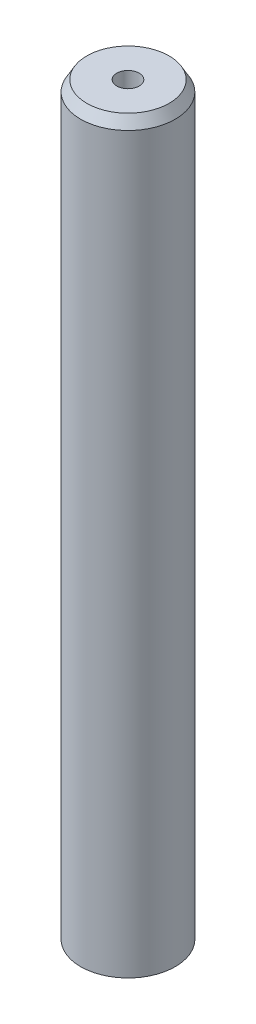
ISO-10303-21;
HEADER;
FILE_DESCRIPTION(('STEP AP214'),'2;1');
FILE_NAME('part.step','',(''),(''),'','','');
FILE_SCHEMA(('AUTOMOTIVE_DESIGN { 1 0 10303 214 1 1 1 1 }'));
ENDSEC;
DATA;
#1=APPLICATION_CONTEXT('core data for automotive mechanical design processes');
#2=APPLICATION_PROTOCOL_DEFINITION('international standard','automotive_design',2000,#1);
#3=PRODUCT_CONTEXT('',#1,'mechanical');
#4=PRODUCT('Part','Part','',(#3));
#5=PRODUCT_RELATED_PRODUCT_CATEGORY('part','',(#4));
#6=PRODUCT_DEFINITION_FORMATION('','',#4);
#7=PRODUCT_DEFINITION_CONTEXT('part definition',#1,'design');
#8=PRODUCT_DEFINITION('design','',#6,#7);
#9=PRODUCT_DEFINITION_SHAPE('','',#8);
#10=(LENGTH_UNIT() NAMED_UNIT(*) SI_UNIT(.MILLI.,.METRE.));
#11=(NAMED_UNIT(*) PLANE_ANGLE_UNIT() SI_UNIT($,.RADIAN.));
#12=(NAMED_UNIT(*) SI_UNIT($,.STERADIAN.) SOLID_ANGLE_UNIT());
#13=UNCERTAINTY_MEASURE_WITH_UNIT(LENGTH_MEASURE(1.E-05),#10,'distance_accuracy_value','');
#14=(GEOMETRIC_REPRESENTATION_CONTEXT(3) GLOBAL_UNCERTAINTY_ASSIGNED_CONTEXT((#13)) GLOBAL_UNIT_ASSIGNED_CONTEXT((#10,
#11,#12)) REPRESENTATION_CONTEXT('',''));
#15=CARTESIAN_POINT('',(0.,0.,0.));
#16=DIRECTION('',(0.,0.,1.));
#17=DIRECTION('',(1.,0.,0.));
#18=AXIS2_PLACEMENT_3D('',#15,#16,#17);
#19=CARTESIAN_POINT('',(0.,79.3357463207847,0.));
#20=DIRECTION('',(0.,-1.,0.));
#21=DIRECTION('',(0.,0.,-1.));
#22=AXIS2_PLACEMENT_3D('',#19,#20,#21);
#23=CYLINDRICAL_SURFACE('',#22,5.);
#24=CARTESIAN_POINT('',(0.,78.2091631415374,0.));
#25=DIRECTION('',(0.,1.,0.));
#26=DIRECTION('',(0.,0.,1.));
#27=AXIS2_PLACEMENT_3D('',#24,#25,#26);
#28=CIRCLE('',#27,5.);
#29=CARTESIAN_POINT('',(0.,78.2091631415374,5.));
#30=VERTEX_POINT('',#29);
#31=EDGE_CURVE('E50',#30,#30,#28,.F.);
#32=ORIENTED_EDGE('',*,*,#31,.T.);
#33=EDGE_LOOP('',(#32));
#34=FACE_BOUND('',#33,.T.);
#35=CARTESIAN_POINT('',(0.,0.650433101802947,0.));
#36=DIRECTION('',(0.,1.,0.));
#37=DIRECTION('',(0.,0.,1.));
#38=AXIS2_PLACEMENT_3D('',#35,#36,#37);
#39=CIRCLE('',#38,5.);
#40=CARTESIAN_POINT('',(0.,0.650433101802947,5.));
#41=VERTEX_POINT('',#40);
#42=EDGE_CURVE('E51',#41,#41,#39,.T.);
#43=ORIENTED_EDGE('',*,*,#42,.T.);
#44=EDGE_LOOP('',(#43));
#45=FACE_BOUND('',#44,.T.);
#46=ADVANCED_FACE('F39',(#34,#45),#23,.T.);
#47=CARTESIAN_POINT('',(0.,79.3357463207847,0.));
#48=DIRECTION('',(0.,1.,0.));
#49=DIRECTION('',(0.,0.,1.));
#50=AXIS2_PLACEMENT_3D('',#47,#48,#49);
#51=PLANE('',#50);
#52=CARTESIAN_POINT('',(0.,79.3357463207847,0.));
#53=DIRECTION('',(0.,1.,0.));
#54=DIRECTION('',(0.,0.,1.));
#55=AXIS2_PLACEMENT_3D('',#52,#53,#54);
#56=CIRCLE('',#55,4.34956689819707);
#57=CARTESIAN_POINT('',(0.,79.3357463207847,4.34956689819707));
#58=VERTEX_POINT('',#57);
#59=EDGE_CURVE('E54',#58,#58,#56,.T.);
#60=ORIENTED_EDGE('',*,*,#59,.T.);
#61=EDGE_LOOP('',(#60));
#62=FACE_BOUND('',#61,.T.);
#63=CARTESIAN_POINT('',(0.,79.3357463207847,0.));
#64=DIRECTION('',(0.,1.,0.));
#65=DIRECTION('',(0.,0.,1.));
#66=AXIS2_PLACEMENT_3D('',#63,#64,#65);
#67=CIRCLE('',#66,1.18509888305625);
#68=CARTESIAN_POINT('',(0.,79.3357463207847,1.18509888305625));
#69=VERTEX_POINT('',#68);
#70=EDGE_CURVE('E58',#69,#69,#67,.T.);
#71=ORIENTED_EDGE('',*,*,#70,.F.);
#72=EDGE_LOOP('',(#71));
#73=FACE_BOUND('',#72,.T.);
#74=ADVANCED_FACE('F69',(#62,#73),#51,.T.);
#75=CARTESIAN_POINT('',(0.,0.,0.));
#76=DIRECTION('',(0.,1.,0.));
#77=DIRECTION('',(0.,0.,1.));
#78=AXIS2_PLACEMENT_3D('',#75,#76,#77);
#79=PLANE('',#78);
#80=CARTESIAN_POINT('',(0.,0.,0.));
#81=DIRECTION('',(0.,1.,0.));
#82=DIRECTION('',(0.,0.,1.));
#83=AXIS2_PLACEMENT_3D('',#80,#81,#82);
#84=CIRCLE('',#83,3.87341682075265);
#85=CARTESIAN_POINT('',(0.,0.,3.87341682075265));
#86=VERTEX_POINT('',#85);
#87=EDGE_CURVE('E10',#86,#86,#84,.F.);
#88=ORIENTED_EDGE('',*,*,#87,.T.);
#89=EDGE_LOOP('',(#88));
#90=FACE_BOUND('',#89,.T.);
#91=CARTESIAN_POINT('',(0.,0.,0.));
#92=DIRECTION('',(0.,1.,0.));
#93=DIRECTION('',(0.,0.,1.));
#94=AXIS2_PLACEMENT_3D('',#91,#92,#93);
#95=CIRCLE('',#94,1.18509888305625);
#96=CARTESIAN_POINT('',(0.,0.,1.18509888305625));
#97=VERTEX_POINT('',#96);
#98=EDGE_CURVE('E63',#97,#97,#95,.T.);
#99=ORIENTED_EDGE('',*,*,#98,.T.);
#100=EDGE_LOOP('',(#99));
#101=FACE_BOUND('',#100,.T.);
#102=ADVANCED_FACE('F75',(#90,#101),#79,.F.);
#103=CARTESIAN_POINT('',(0.,79.3357463207847,0.));
#104=DIRECTION('',(0.,-1.,0.));
#105=DIRECTION('',(0.,0.,-1.));
#106=AXIS2_PLACEMENT_3D('',#103,#104,#105);
#107=CYLINDRICAL_SURFACE('',#106,1.18509888305625);
#108=ORIENTED_EDGE('',*,*,#70,.T.);
#109=EDGE_LOOP('',(#108));
#110=FACE_BOUND('',#109,.T.);
#111=ORIENTED_EDGE('',*,*,#98,.F.);
#112=EDGE_LOOP('',(#111));
#113=FACE_BOUND('',#112,.T.);
#114=ADVANCED_FACE('F70',(#110,#113),#107,.F.);
#115=CARTESIAN_POINT('',(0.,79.3357463207847,0.));
#116=DIRECTION('',(0.,-1.,0.));
#117=DIRECTION('',(0.,0.,-1.));
#118=AXIS2_PLACEMENT_3D('',#115,#116,#117);
#119=CONICAL_SURFACE('',#118,4.34956689819707,0.523598775598291);
#120=ORIENTED_EDGE('',*,*,#31,.F.);
#121=EDGE_LOOP('',(#120));
#122=FACE_BOUND('',#121,.T.);
#123=ORIENTED_EDGE('',*,*,#59,.F.);
#124=EDGE_LOOP('',(#123));
#125=FACE_BOUND('',#124,.T.);
#126=ADVANCED_FACE('F81',(#122,#125),#119,.T.);
#127=CARTESIAN_POINT('',(0.,0.650433101802947,0.));
#128=DIRECTION('',(0.,1.,0.));
#129=DIRECTION('',(0.,0.,1.));
#130=AXIS2_PLACEMENT_3D('',#127,#128,#129);
#131=CONICAL_SURFACE('',#130,5.,1.04719755119661);
#132=ORIENTED_EDGE('',*,*,#87,.F.);
#133=EDGE_LOOP('',(#132));
#134=FACE_BOUND('',#133,.T.);
#135=ORIENTED_EDGE('',*,*,#42,.F.);
#136=EDGE_LOOP('',(#135));
#137=FACE_BOUND('',#136,.T.);
#138=ADVANCED_FACE('F45',(#134,#137),#131,.T.);
#139=CLOSED_SHELL('',(#46,#74,#102,#114,#126,#138));
#140=MANIFOLD_SOLID_BREP('B2',#139);
#141=ADVANCED_BREP_SHAPE_REPRESENTATION('',(#18,#140),#14);
#142=SHAPE_DEFINITION_REPRESENTATION(#9,#141);
ENDSEC;
END-ISO-10303-21;
